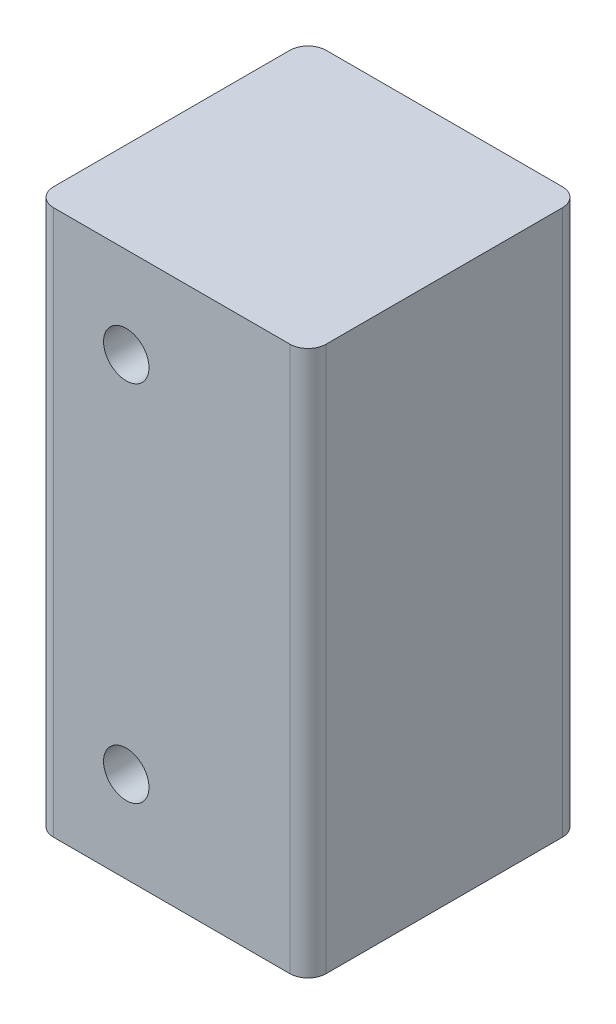
ISO-10303-21;
HEADER;
FILE_DESCRIPTION(('STEP AP214'),'2;1');
FILE_NAME('part.step','',(''),(''),'','','');
FILE_SCHEMA(('AUTOMOTIVE_DESIGN { 1 0 10303 214 1 1 1 1 }'));
ENDSEC;
DATA;
#1=APPLICATION_CONTEXT('core data for automotive mechanical design processes');
#2=APPLICATION_PROTOCOL_DEFINITION('international standard','automotive_design',2000,#1);
#3=PRODUCT_CONTEXT('',#1,'mechanical');
#4=PRODUCT('Part','Part','',(#3));
#5=PRODUCT_RELATED_PRODUCT_CATEGORY('part','',(#4));
#6=PRODUCT_DEFINITION_FORMATION('','',#4);
#7=PRODUCT_DEFINITION_CONTEXT('part definition',#1,'design');
#8=PRODUCT_DEFINITION('design','',#6,#7);
#9=PRODUCT_DEFINITION_SHAPE('','',#8);
#10=(LENGTH_UNIT() NAMED_UNIT(*) SI_UNIT(.MILLI.,.METRE.));
#11=(NAMED_UNIT(*) PLANE_ANGLE_UNIT() SI_UNIT($,.RADIAN.));
#12=(NAMED_UNIT(*) SI_UNIT($,.STERADIAN.) SOLID_ANGLE_UNIT());
#13=UNCERTAINTY_MEASURE_WITH_UNIT(LENGTH_MEASURE(1.E-05),#10,'distance_accuracy_value','');
#14=(GEOMETRIC_REPRESENTATION_CONTEXT(3) GLOBAL_UNCERTAINTY_ASSIGNED_CONTEXT((#13)) GLOBAL_UNIT_ASSIGNED_CONTEXT((#10,
#11,#12)) REPRESENTATION_CONTEXT('',''));
#15=CARTESIAN_POINT('',(0.,0.,0.));
#16=DIRECTION('',(0.,0.,1.));
#17=DIRECTION('',(1.,0.,0.));
#18=AXIS2_PLACEMENT_3D('',#15,#16,#17);
#19=CARTESIAN_POINT('',(0.,60.,30.));
#20=DIRECTION('',(0.,0.,-1.));
#21=DIRECTION('',(-1.,0.,0.));
#22=AXIS2_PLACEMENT_3D('',#19,#20,#21);
#23=PLANE('',#22);
#24=CARTESIAN_POINT('',(10.,50.,30.));
#25=DIRECTION('',(0.,0.,1.));
#26=DIRECTION('',(1.,0.,0.));
#27=AXIS2_PLACEMENT_3D('',#24,#25,#26);
#28=CIRCLE('',#27,2.5);
#29=CARTESIAN_POINT('',(12.5,50.,30.));
#30=VERTEX_POINT('',#29);
#31=EDGE_CURVE('E159',#30,#30,#28,.T.);
#32=ORIENTED_EDGE('',*,*,#31,.F.);
#33=EDGE_LOOP('',(#32));
#34=FACE_BOUND('',#33,.T.);
#35=DIRECTION('',(1.,0.,0.));
#36=VECTOR('',#35,1.);
#37=CARTESIAN_POINT('',(0.,0.,30.));
#38=LINE('',#37,#36);
#39=CARTESIAN_POINT('',(2.,0.,30.));
#40=VERTEX_POINT('',#39);
#41=CARTESIAN_POINT('',(28.,0.,30.));
#42=VERTEX_POINT('',#41);
#43=EDGE_CURVE('E103',#40,#42,#38,.T.);
#44=ORIENTED_EDGE('',*,*,#43,.T.);
#45=DIRECTION('',(0.,1.,0.));
#46=VECTOR('',#45,1.);
#47=CARTESIAN_POINT('',(28.,60.,30.));
#48=LINE('',#47,#46);
#49=CARTESIAN_POINT('',(28.,60.,30.));
#50=VERTEX_POINT('',#49);
#51=EDGE_CURVE('E11',#42,#50,#48,.T.);
#52=ORIENTED_EDGE('',*,*,#51,.T.);
#53=DIRECTION('',(-1.,0.,0.));
#54=VECTOR('',#53,1.);
#55=CARTESIAN_POINT('',(0.,60.,30.));
#56=LINE('',#55,#54);
#57=CARTESIAN_POINT('',(2.,60.,30.));
#58=VERTEX_POINT('',#57);
#59=EDGE_CURVE('E147',#50,#58,#56,.T.);
#60=ORIENTED_EDGE('',*,*,#59,.T.);
#61=DIRECTION('',(0.,-1.,0.));
#62=VECTOR('',#61,1.);
#63=CARTESIAN_POINT('',(2.,60.,30.));
#64=LINE('',#63,#62);
#65=EDGE_CURVE('E39',#58,#40,#64,.T.);
#66=ORIENTED_EDGE('',*,*,#65,.T.);
#67=EDGE_LOOP('',(#44,#52,#60,#66));
#68=FACE_BOUND('',#67,.T.);
#69=CARTESIAN_POINT('',(10.,10.,30.));
#70=DIRECTION('',(0.,0.,1.));
#71=DIRECTION('',(-1.,0.,0.));
#72=AXIS2_PLACEMENT_3D('',#69,#70,#71);
#73=CIRCLE('',#72,2.5);
#74=CARTESIAN_POINT('',(7.5,10.,30.));
#75=VERTEX_POINT('',#74);
#76=EDGE_CURVE('E222',#75,#75,#73,.T.);
#77=ORIENTED_EDGE('',*,*,#76,.F.);
#78=EDGE_LOOP('',(#77));
#79=FACE_BOUND('',#78,.T.);
#80=ADVANCED_FACE('F31',(#34,#68,#79),#23,.F.);
#81=CARTESIAN_POINT('',(0.,60.,0.));
#82=DIRECTION('',(0.,0.,-1.));
#83=DIRECTION('',(-1.,0.,0.));
#84=AXIS2_PLACEMENT_3D('',#81,#82,#83);
#85=PLANE('',#84);
#86=CARTESIAN_POINT('',(10.,50.,0.));
#87=DIRECTION('',(0.,0.,1.));
#88=DIRECTION('',(1.,0.,0.));
#89=AXIS2_PLACEMENT_3D('',#86,#87,#88);
#90=CIRCLE('',#89,2.5);
#91=CARTESIAN_POINT('',(12.5,50.,0.));
#92=VERTEX_POINT('',#91);
#93=EDGE_CURVE('E227',#92,#92,#90,.T.);
#94=ORIENTED_EDGE('',*,*,#93,.T.);
#95=EDGE_LOOP('',(#94));
#96=FACE_BOUND('',#95,.T.);
#97=DIRECTION('',(1.,0.,0.));
#98=VECTOR('',#97,1.);
#99=CARTESIAN_POINT('',(0.,0.,0.));
#100=LINE('',#99,#98);
#101=CARTESIAN_POINT('',(2.,0.,0.));
#102=VERTEX_POINT('',#101);
#103=CARTESIAN_POINT('',(28.,0.,0.));
#104=VERTEX_POINT('',#103);
#105=EDGE_CURVE('E156',#102,#104,#100,.T.);
#106=ORIENTED_EDGE('',*,*,#105,.F.);
#107=DIRECTION('',(0.,-1.,0.));
#108=VECTOR('',#107,1.);
#109=CARTESIAN_POINT('',(2.,60.,0.));
#110=LINE('',#109,#108);
#111=CARTESIAN_POINT('',(2.,60.,0.));
#112=VERTEX_POINT('',#111);
#113=EDGE_CURVE('E133',#102,#112,#110,.F.);
#114=ORIENTED_EDGE('',*,*,#113,.T.);
#115=DIRECTION('',(-1.,0.,0.));
#116=VECTOR('',#115,1.);
#117=CARTESIAN_POINT('',(0.,60.,0.));
#118=LINE('',#117,#116);
#119=CARTESIAN_POINT('',(28.,60.,0.));
#120=VERTEX_POINT('',#119);
#121=EDGE_CURVE('E152',#120,#112,#118,.T.);
#122=ORIENTED_EDGE('',*,*,#121,.F.);
#123=DIRECTION('',(0.,1.,0.));
#124=VECTOR('',#123,1.);
#125=CARTESIAN_POINT('',(28.,0.,0.));
#126=LINE('',#125,#124);
#127=EDGE_CURVE('E131',#120,#104,#126,.F.);
#128=ORIENTED_EDGE('',*,*,#127,.T.);
#129=EDGE_LOOP('',(#106,#114,#122,#128));
#130=FACE_BOUND('',#129,.T.);
#131=CARTESIAN_POINT('',(10.,10.,0.));
#132=DIRECTION('',(0.,0.,1.));
#133=DIRECTION('',(-1.,0.,0.));
#134=AXIS2_PLACEMENT_3D('',#131,#132,#133);
#135=CIRCLE('',#134,2.5);
#136=CARTESIAN_POINT('',(7.5,10.,0.));
#137=VERTEX_POINT('',#136);
#138=EDGE_CURVE('E225',#137,#137,#135,.T.);
#139=ORIENTED_EDGE('',*,*,#138,.T.);
#140=EDGE_LOOP('',(#139));
#141=FACE_BOUND('',#140,.T.);
#142=ADVANCED_FACE('F173',(#96,#130,#141),#85,.T.);
#143=CARTESIAN_POINT('',(0.,0.,30.));
#144=DIRECTION('',(1.,0.,0.));
#145=DIRECTION('',(0.,0.,-1.));
#146=AXIS2_PLACEMENT_3D('',#143,#144,#145);
#147=PLANE('',#146);
#148=DIRECTION('',(0.,0.,-1.));
#149=VECTOR('',#148,1.);
#150=CARTESIAN_POINT('',(0.,60.,30.));
#151=LINE('',#150,#149);
#152=CARTESIAN_POINT('',(0.,60.,28.));
#153=VERTEX_POINT('',#152);
#154=CARTESIAN_POINT('',(0.,60.,2.));
#155=VERTEX_POINT('',#154);
#156=EDGE_CURVE('E148',#153,#155,#151,.T.);
#157=ORIENTED_EDGE('',*,*,#156,.T.);
#158=DIRECTION('',(0.,-1.,0.));
#159=VECTOR('',#158,1.);
#160=CARTESIAN_POINT('',(0.,0.,2.));
#161=LINE('',#160,#159);
#162=CARTESIAN_POINT('',(0.,0.,2.));
#163=VERTEX_POINT('',#162);
#164=EDGE_CURVE('E109',#155,#163,#161,.T.);
#165=ORIENTED_EDGE('',*,*,#164,.T.);
#166=DIRECTION('',(0.,0.,-1.));
#167=VECTOR('',#166,1.);
#168=CARTESIAN_POINT('',(0.,0.,30.));
#169=LINE('',#168,#167);
#170=CARTESIAN_POINT('',(0.,0.,28.));
#171=VERTEX_POINT('',#170);
#172=EDGE_CURVE('E101',#171,#163,#169,.T.);
#173=ORIENTED_EDGE('',*,*,#172,.F.);
#174=DIRECTION('',(0.,-1.,0.));
#175=VECTOR('',#174,1.);
#176=CARTESIAN_POINT('',(0.,0.,28.));
#177=LINE('',#176,#175);
#178=EDGE_CURVE('E115',#171,#153,#177,.F.);
#179=ORIENTED_EDGE('',*,*,#178,.T.);
#180=EDGE_LOOP('',(#157,#165,#173,#179));
#181=FACE_BOUND('',#180,.T.);
#182=ADVANCED_FACE('F114',(#181),#147,.F.);
#183=CARTESIAN_POINT('',(0.,0.,30.));
#184=DIRECTION('',(0.,1.,0.));
#185=DIRECTION('',(0.,0.,1.));
#186=AXIS2_PLACEMENT_3D('',#183,#184,#185);
#187=PLANE('',#186);
#188=ORIENTED_EDGE('',*,*,#172,.T.);
#189=CARTESIAN_POINT('',(2.,0.,2.));
#190=DIRECTION('',(0.,1.,0.));
#191=DIRECTION('',(0.,0.,1.));
#192=AXIS2_PLACEMENT_3D('',#189,#190,#191);
#193=CIRCLE('',#192,2.);
#194=EDGE_CURVE('E129',#163,#102,#193,.F.);
#195=ORIENTED_EDGE('',*,*,#194,.T.);
#196=ORIENTED_EDGE('',*,*,#105,.T.);
#197=CARTESIAN_POINT('',(28.,0.,2.));
#198=DIRECTION('',(0.,1.,0.));
#199=DIRECTION('',(0.,0.,1.));
#200=AXIS2_PLACEMENT_3D('',#197,#198,#199);
#201=CIRCLE('',#200,2.);
#202=CARTESIAN_POINT('',(30.,0.,2.));
#203=VERTEX_POINT('',#202);
#204=EDGE_CURVE('E127',#104,#203,#201,.F.);
#205=ORIENTED_EDGE('',*,*,#204,.T.);
#206=DIRECTION('',(0.,0.,-1.));
#207=VECTOR('',#206,1.);
#208=CARTESIAN_POINT('',(30.,0.,30.));
#209=LINE('',#208,#207);
#210=CARTESIAN_POINT('',(30.,0.,28.));
#211=VERTEX_POINT('',#210);
#212=EDGE_CURVE('E118',#211,#203,#209,.T.);
#213=ORIENTED_EDGE('',*,*,#212,.F.);
#214=CARTESIAN_POINT('',(28.,0.,28.));
#215=DIRECTION('',(0.,1.,0.));
#216=DIRECTION('',(0.,0.,1.));
#217=AXIS2_PLACEMENT_3D('',#214,#215,#216);
#218=CIRCLE('',#217,2.);
#219=EDGE_CURVE('E108',#211,#42,#218,.F.);
#220=ORIENTED_EDGE('',*,*,#219,.T.);
#221=ORIENTED_EDGE('',*,*,#43,.F.);
#222=CARTESIAN_POINT('',(2.,0.,28.));
#223=DIRECTION('',(0.,1.,0.));
#224=DIRECTION('',(0.,0.,1.));
#225=AXIS2_PLACEMENT_3D('',#222,#223,#224);
#226=CIRCLE('',#225,2.);
#227=EDGE_CURVE('E98',#40,#171,#226,.F.);
#228=ORIENTED_EDGE('',*,*,#227,.T.);
#229=EDGE_LOOP('',(#188,#195,#196,#205,#213,#220,#221,#228));
#230=FACE_BOUND('',#229,.T.);
#231=ADVANCED_FACE('F100',(#230),#187,.F.);
#232=CARTESIAN_POINT('',(30.,0.,30.));
#233=DIRECTION('',(-1.,0.,0.));
#234=DIRECTION('',(0.,0.,1.));
#235=AXIS2_PLACEMENT_3D('',#232,#233,#234);
#236=PLANE('',#235);
#237=ORIENTED_EDGE('',*,*,#212,.T.);
#238=DIRECTION('',(0.,1.,0.));
#239=VECTOR('',#238,1.);
#240=CARTESIAN_POINT('',(30.,60.,2.));
#241=LINE('',#240,#239);
#242=CARTESIAN_POINT('',(30.,60.,2.));
#243=VERTEX_POINT('',#242);
#244=EDGE_CURVE('E142',#203,#243,#241,.T.);
#245=ORIENTED_EDGE('',*,*,#244,.T.);
#246=DIRECTION('',(0.,0.,-1.));
#247=VECTOR('',#246,1.);
#248=CARTESIAN_POINT('',(30.,60.,30.));
#249=LINE('',#248,#247);
#250=CARTESIAN_POINT('',(30.,60.,28.));
#251=VERTEX_POINT('',#250);
#252=EDGE_CURVE('E150',#251,#243,#249,.T.);
#253=ORIENTED_EDGE('',*,*,#252,.F.);
#254=DIRECTION('',(0.,1.,0.));
#255=VECTOR('',#254,1.);
#256=CARTESIAN_POINT('',(30.,0.,28.));
#257=LINE('',#256,#255);
#258=EDGE_CURVE('E140',#251,#211,#257,.F.);
#259=ORIENTED_EDGE('',*,*,#258,.T.);
#260=EDGE_LOOP('',(#237,#245,#253,#259));
#261=FACE_BOUND('',#260,.T.);
#262=ADVANCED_FACE('F165',(#261),#236,.F.);
#263=CARTESIAN_POINT('',(0.,60.,30.));
#264=DIRECTION('',(0.,-1.,0.));
#265=DIRECTION('',(0.,0.,-1.));
#266=AXIS2_PLACEMENT_3D('',#263,#264,#265);
#267=PLANE('',#266);
#268=ORIENTED_EDGE('',*,*,#121,.T.);
#269=CARTESIAN_POINT('',(2.,60.,2.));
#270=DIRECTION('',(0.,-1.,0.));
#271=DIRECTION('',(0.,0.,-1.));
#272=AXIS2_PLACEMENT_3D('',#269,#270,#271);
#273=CIRCLE('',#272,2.);
#274=EDGE_CURVE('E138',#112,#155,#273,.F.);
#275=ORIENTED_EDGE('',*,*,#274,.T.);
#276=ORIENTED_EDGE('',*,*,#156,.F.);
#277=CARTESIAN_POINT('',(2.,60.,28.));
#278=DIRECTION('',(0.,-1.,0.));
#279=DIRECTION('',(0.,0.,-1.));
#280=AXIS2_PLACEMENT_3D('',#277,#278,#279);
#281=CIRCLE('',#280,2.);
#282=EDGE_CURVE('E121',#153,#58,#281,.F.);
#283=ORIENTED_EDGE('',*,*,#282,.T.);
#284=ORIENTED_EDGE('',*,*,#59,.F.);
#285=CARTESIAN_POINT('',(28.,60.,28.));
#286=DIRECTION('',(0.,-1.,0.));
#287=DIRECTION('',(0.,0.,-1.));
#288=AXIS2_PLACEMENT_3D('',#285,#286,#287);
#289=CIRCLE('',#288,2.);
#290=EDGE_CURVE('E54',#50,#251,#289,.F.);
#291=ORIENTED_EDGE('',*,*,#290,.T.);
#292=ORIENTED_EDGE('',*,*,#252,.T.);
#293=CARTESIAN_POINT('',(28.,60.,2.));
#294=DIRECTION('',(0.,-1.,0.));
#295=DIRECTION('',(0.,0.,-1.));
#296=AXIS2_PLACEMENT_3D('',#293,#294,#295);
#297=CIRCLE('',#296,2.);
#298=EDGE_CURVE('E46',#243,#120,#297,.F.);
#299=ORIENTED_EDGE('',*,*,#298,.T.);
#300=EDGE_LOOP('',(#268,#275,#276,#283,#284,#291,#292,#299));
#301=FACE_BOUND('',#300,.T.);
#302=ADVANCED_FACE('F179',(#301),#267,.F.);
#303=CARTESIAN_POINT('',(10.,50.,30.));
#304=DIRECTION('',(0.,0.,-1.));
#305=DIRECTION('',(-1.,0.,0.));
#306=AXIS2_PLACEMENT_3D('',#303,#304,#305);
#307=CYLINDRICAL_SURFACE('',#306,2.5);
#308=ORIENTED_EDGE('',*,*,#31,.T.);
#309=EDGE_LOOP('',(#308));
#310=FACE_BOUND('',#309,.T.);
#311=ORIENTED_EDGE('',*,*,#93,.F.);
#312=EDGE_LOOP('',(#311));
#313=FACE_BOUND('',#312,.T.);
#314=ADVANCED_FACE('F198',(#310,#313),#307,.F.);
#315=CARTESIAN_POINT('',(10.,10.,30.));
#316=DIRECTION('',(0.,0.,-1.));
#317=DIRECTION('',(-1.,0.,0.));
#318=AXIS2_PLACEMENT_3D('',#315,#316,#317);
#319=CYLINDRICAL_SURFACE('',#318,2.5);
#320=ORIENTED_EDGE('',*,*,#76,.T.);
#321=EDGE_LOOP('',(#320));
#322=FACE_BOUND('',#321,.T.);
#323=ORIENTED_EDGE('',*,*,#138,.F.);
#324=EDGE_LOOP('',(#323));
#325=FACE_BOUND('',#324,.T.);
#326=ADVANCED_FACE('F210',(#322,#325),#319,.F.);
#327=CARTESIAN_POINT('',(2.,0.,2.));
#328=DIRECTION('',(0.,1.,0.));
#329=DIRECTION('',(0.,0.,1.));
#330=AXIS2_PLACEMENT_3D('',#327,#328,#329);
#331=CYLINDRICAL_SURFACE('',#330,2.);
#332=ORIENTED_EDGE('',*,*,#274,.F.);
#333=ORIENTED_EDGE('',*,*,#113,.F.);
#334=ORIENTED_EDGE('',*,*,#194,.F.);
#335=ORIENTED_EDGE('',*,*,#164,.F.);
#336=EDGE_LOOP('',(#332,#333,#334,#335));
#337=FACE_BOUND('',#336,.T.);
#338=ADVANCED_FACE('F178',(#337),#331,.T.);
#339=CARTESIAN_POINT('',(28.,0.,2.));
#340=DIRECTION('',(0.,-1.,0.));
#341=DIRECTION('',(0.,0.,-1.));
#342=AXIS2_PLACEMENT_3D('',#339,#340,#341);
#343=CYLINDRICAL_SURFACE('',#342,2.);
#344=ORIENTED_EDGE('',*,*,#204,.F.);
#345=ORIENTED_EDGE('',*,*,#127,.F.);
#346=ORIENTED_EDGE('',*,*,#298,.F.);
#347=ORIENTED_EDGE('',*,*,#244,.F.);
#348=EDGE_LOOP('',(#344,#345,#346,#347));
#349=FACE_BOUND('',#348,.T.);
#350=ADVANCED_FACE('F169',(#349),#343,.T.);
#351=CARTESIAN_POINT('',(28.,60.,28.));
#352=DIRECTION('',(0.,1.,0.));
#353=DIRECTION('',(0.,0.,1.));
#354=AXIS2_PLACEMENT_3D('',#351,#352,#353);
#355=CYLINDRICAL_SURFACE('',#354,2.);
#356=ORIENTED_EDGE('',*,*,#219,.F.);
#357=ORIENTED_EDGE('',*,*,#258,.F.);
#358=ORIENTED_EDGE('',*,*,#290,.F.);
#359=ORIENTED_EDGE('',*,*,#51,.F.);
#360=EDGE_LOOP('',(#356,#357,#358,#359));
#361=FACE_BOUND('',#360,.T.);
#362=ADVANCED_FACE('F181',(#361),#355,.T.);
#363=CARTESIAN_POINT('',(2.,60.,28.));
#364=DIRECTION('',(0.,-1.,0.));
#365=DIRECTION('',(0.,0.,-1.));
#366=AXIS2_PLACEMENT_3D('',#363,#364,#365);
#367=CYLINDRICAL_SURFACE('',#366,2.);
#368=ORIENTED_EDGE('',*,*,#282,.F.);
#369=ORIENTED_EDGE('',*,*,#178,.F.);
#370=ORIENTED_EDGE('',*,*,#227,.F.);
#371=ORIENTED_EDGE('',*,*,#65,.F.);
#372=EDGE_LOOP('',(#368,#369,#370,#371));
#373=FACE_BOUND('',#372,.T.);
#374=ADVANCED_FACE('F33',(#373),#367,.T.);
#375=CLOSED_SHELL('',(#80,#142,#182,#231,#262,#302,#314,#326,#338,#350,#362,#374));
#376=MANIFOLD_SOLID_BREP('B2',#375);
#377=ADVANCED_BREP_SHAPE_REPRESENTATION('',(#18,#376),#14);
#378=SHAPE_DEFINITION_REPRESENTATION(#9,#377);
ENDSEC;
END-ISO-10303-21;
